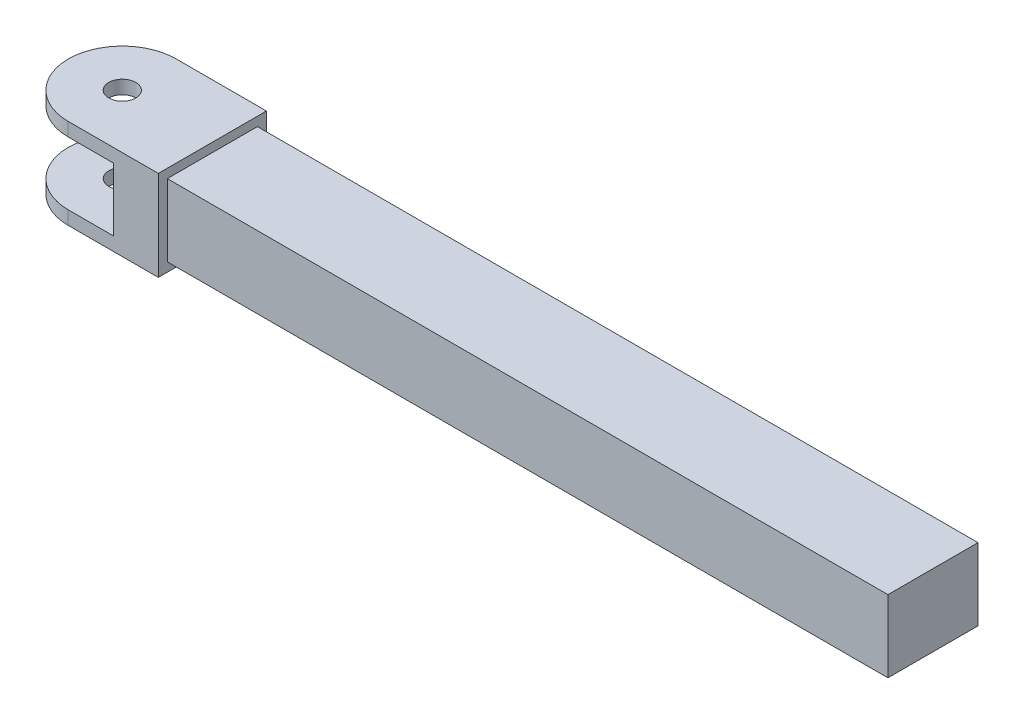
ISO-10303-21;
HEADER;
FILE_DESCRIPTION(('STEP AP214'),'2;1');
FILE_NAME('part.step','',(''),(''),'','','');
FILE_SCHEMA(('AUTOMOTIVE_DESIGN { 1 0 10303 214 1 1 1 1 }'));
ENDSEC;
DATA;
#1=APPLICATION_CONTEXT('core data for automotive mechanical design processes');
#2=APPLICATION_PROTOCOL_DEFINITION('international standard','automotive_design',2000,#1);
#3=PRODUCT_CONTEXT('',#1,'mechanical');
#4=PRODUCT('Part','Part','',(#3));
#5=PRODUCT_RELATED_PRODUCT_CATEGORY('part','',(#4));
#6=PRODUCT_DEFINITION_FORMATION('','',#4);
#7=PRODUCT_DEFINITION_CONTEXT('part definition',#1,'design');
#8=PRODUCT_DEFINITION('design','',#6,#7);
#9=PRODUCT_DEFINITION_SHAPE('','',#8);
#10=(LENGTH_UNIT() NAMED_UNIT(*) SI_UNIT(.MILLI.,.METRE.));
#11=(NAMED_UNIT(*) PLANE_ANGLE_UNIT() SI_UNIT($,.RADIAN.));
#12=(NAMED_UNIT(*) SI_UNIT($,.STERADIAN.) SOLID_ANGLE_UNIT());
#13=UNCERTAINTY_MEASURE_WITH_UNIT(LENGTH_MEASURE(1.E-05),#10,'distance_accuracy_value','');
#14=(GEOMETRIC_REPRESENTATION_CONTEXT(3) GLOBAL_UNCERTAINTY_ASSIGNED_CONTEXT((#13)) GLOBAL_UNIT_ASSIGNED_CONTEXT((#10,
#11,#12)) REPRESENTATION_CONTEXT('',''));
#15=CARTESIAN_POINT('',(0.,0.,0.));
#16=DIRECTION('',(0.,0.,1.));
#17=DIRECTION('',(1.,0.,0.));
#18=AXIS2_PLACEMENT_3D('',#15,#16,#17);
#19=CARTESIAN_POINT('',(0.,10.,0.));
#20=DIRECTION('',(0.,1.,0.));
#21=DIRECTION('',(0.,0.,1.));
#22=AXIS2_PLACEMENT_3D('',#19,#20,#21);
#23=PLANE('',#22);
#24=CARTESIAN_POINT('',(0.,10.,0.));
#25=DIRECTION('',(0.,1.,0.));
#26=DIRECTION('',(0.,0.,1.));
#27=AXIS2_PLACEMENT_3D('',#24,#25,#26);
#28=CIRCLE('',#27,1.5);
#29=CARTESIAN_POINT('',(0.,10.,1.5));
#30=VERTEX_POINT('',#29);
#31=EDGE_CURVE('E244',#30,#30,#28,.T.);
#32=ORIENTED_EDGE('',*,*,#31,.F.);
#33=EDGE_LOOP('',(#32));
#34=FACE_BOUND('',#33,.T.);
#35=DIRECTION('',(1.,0.,0.));
#36=VECTOR('',#35,1.);
#37=CARTESIAN_POINT('',(0.,10.,6.));
#38=LINE('',#37,#36);
#39=CARTESIAN_POINT('',(0.,10.,6.));
#40=VERTEX_POINT('',#39);
#41=CARTESIAN_POINT('',(9.99999999999999,10.,6.));
#42=VERTEX_POINT('',#41);
#43=EDGE_CURVE('E256',#40,#42,#38,.T.);
#44=ORIENTED_EDGE('',*,*,#43,.T.);
#45=DIRECTION('',(0.,0.,-1.));
#46=VECTOR('',#45,1.);
#47=CARTESIAN_POINT('',(9.99999999999999,10.,0.));
#48=LINE('',#47,#46);
#49=CARTESIAN_POINT('',(9.99999999999999,10.,-6.));
#50=VERTEX_POINT('',#49);
#51=EDGE_CURVE('E199',#42,#50,#48,.T.);
#52=ORIENTED_EDGE('',*,*,#51,.T.);
#53=DIRECTION('',(-1.,0.,0.));
#54=VECTOR('',#53,1.);
#55=CARTESIAN_POINT('',(0.,10.,-6.));
#56=LINE('',#55,#54);
#57=CARTESIAN_POINT('',(0.,10.,-6.));
#58=VERTEX_POINT('',#57);
#59=EDGE_CURVE('E261',#50,#58,#56,.T.);
#60=ORIENTED_EDGE('',*,*,#59,.T.);
#61=CARTESIAN_POINT('',(0.,10.,0.));
#62=DIRECTION('',(0.,1.,0.));
#63=DIRECTION('',(0.,0.,1.));
#64=AXIS2_PLACEMENT_3D('',#61,#62,#63);
#65=CIRCLE('',#64,6.);
#66=EDGE_CURVE('E252',#58,#40,#65,.T.);
#67=ORIENTED_EDGE('',*,*,#66,.T.);
#68=EDGE_LOOP('',(#44,#52,#60,#67));
#69=FACE_BOUND('',#68,.T.);
#70=ADVANCED_FACE('F53',(#34,#69),#23,.T.);
#71=CARTESIAN_POINT('',(0.,0.,0.));
#72=DIRECTION('',(0.,1.,0.));
#73=DIRECTION('',(0.,0.,1.));
#74=AXIS2_PLACEMENT_3D('',#71,#72,#73);
#75=PLANE('',#74);
#76=CARTESIAN_POINT('',(0.,0.,0.));
#77=DIRECTION('',(0.,1.,0.));
#78=DIRECTION('',(0.,0.,1.));
#79=AXIS2_PLACEMENT_3D('',#76,#77,#78);
#80=CIRCLE('',#79,1.5);
#81=CARTESIAN_POINT('',(0.,0.,1.5));
#82=VERTEX_POINT('',#81);
#83=EDGE_CURVE('E243',#82,#82,#80,.T.);
#84=ORIENTED_EDGE('',*,*,#83,.T.);
#85=EDGE_LOOP('',(#84));
#86=FACE_BOUND('',#85,.T.);
#87=DIRECTION('',(0.,0.,-1.));
#88=VECTOR('',#87,1.);
#89=CARTESIAN_POINT('',(9.99999999999999,0.,0.));
#90=LINE('',#89,#88);
#91=CARTESIAN_POINT('',(9.99999999999999,0.,6.));
#92=VERTEX_POINT('',#91);
#93=CARTESIAN_POINT('',(9.99999999999999,0.,-6.));
#94=VERTEX_POINT('',#93);
#95=EDGE_CURVE('E76',#92,#94,#90,.T.);
#96=ORIENTED_EDGE('',*,*,#95,.F.);
#97=DIRECTION('',(1.,0.,0.));
#98=VECTOR('',#97,1.);
#99=CARTESIAN_POINT('',(0.,0.,6.));
#100=LINE('',#99,#98);
#101=CARTESIAN_POINT('',(0.,0.,6.));
#102=VERTEX_POINT('',#101);
#103=EDGE_CURVE('E268',#102,#92,#100,.T.);
#104=ORIENTED_EDGE('',*,*,#103,.F.);
#105=CARTESIAN_POINT('',(0.,0.,0.));
#106=DIRECTION('',(0.,1.,0.));
#107=DIRECTION('',(0.,0.,1.));
#108=AXIS2_PLACEMENT_3D('',#105,#106,#107);
#109=CIRCLE('',#108,6.);
#110=CARTESIAN_POINT('',(0.,0.,-6.));
#111=VERTEX_POINT('',#110);
#112=EDGE_CURVE('E248',#111,#102,#109,.T.);
#113=ORIENTED_EDGE('',*,*,#112,.F.);
#114=DIRECTION('',(-1.,0.,0.));
#115=VECTOR('',#114,1.);
#116=CARTESIAN_POINT('',(0.,0.,-6.));
#117=LINE('',#116,#115);
#118=EDGE_CURVE('E257',#94,#111,#117,.T.);
#119=ORIENTED_EDGE('',*,*,#118,.F.);
#120=EDGE_LOOP('',(#96,#104,#113,#119));
#121=FACE_BOUND('',#120,.T.);
#122=ADVANCED_FACE('F300',(#86,#121),#75,.F.);
#123=CARTESIAN_POINT('',(0.,10.,6.));
#124=DIRECTION('',(0.,0.,-1.));
#125=DIRECTION('',(-1.,0.,0.));
#126=AXIS2_PLACEMENT_3D('',#123,#124,#125);
#127=PLANE('',#126);
#128=DIRECTION('',(0.,-1.,0.));
#129=VECTOR('',#128,1.);
#130=CARTESIAN_POINT('',(9.99999999999999,10.,6.));
#131=LINE('',#130,#129);
#132=EDGE_CURVE('E203',#42,#92,#131,.T.);
#133=ORIENTED_EDGE('',*,*,#132,.F.);
#134=ORIENTED_EDGE('',*,*,#43,.F.);
#135=DIRECTION('',(0.,-1.,0.));
#136=VECTOR('',#135,1.);
#137=CARTESIAN_POINT('',(0.,10.,6.));
#138=LINE('',#137,#136);
#139=CARTESIAN_POINT('',(0.,8.5,6.));
#140=VERTEX_POINT('',#139);
#141=EDGE_CURVE('E62',#40,#140,#138,.T.);
#142=ORIENTED_EDGE('',*,*,#141,.T.);
#143=DIRECTION('',(1.,0.,0.));
#144=VECTOR('',#143,1.);
#145=CARTESIAN_POINT('',(5.,8.5,6.));
#146=LINE('',#145,#144);
#147=CARTESIAN_POINT('',(5.,8.5,6.));
#148=VERTEX_POINT('',#147);
#149=EDGE_CURVE('E207',#140,#148,#146,.T.);
#150=ORIENTED_EDGE('',*,*,#149,.T.);
#151=DIRECTION('',(0.,-1.,0.));
#152=VECTOR('',#151,1.);
#153=CARTESIAN_POINT('',(5.,8.5,6.));
#154=LINE('',#153,#152);
#155=CARTESIAN_POINT('',(5.,1.5,6.));
#156=VERTEX_POINT('',#155);
#157=EDGE_CURVE('E211',#148,#156,#154,.T.);
#158=ORIENTED_EDGE('',*,*,#157,.T.);
#159=DIRECTION('',(-1.,0.,0.));
#160=VECTOR('',#159,1.);
#161=CARTESIAN_POINT('',(5.,1.5,6.));
#162=LINE('',#161,#160);
#163=CARTESIAN_POINT('',(0.,1.5,6.));
#164=VERTEX_POINT('',#163);
#165=EDGE_CURVE('E216',#156,#164,#162,.T.);
#166=ORIENTED_EDGE('',*,*,#165,.T.);
#167=EDGE_CURVE('E278',#164,#102,#138,.T.);
#168=ORIENTED_EDGE('',*,*,#167,.T.);
#169=ORIENTED_EDGE('',*,*,#103,.T.);
#170=EDGE_LOOP('',(#133,#134,#142,#150,#158,#166,#168,#169));
#171=FACE_BOUND('',#170,.T.);
#172=ADVANCED_FACE('F303',(#171),#127,.F.);
#173=CARTESIAN_POINT('',(0.,10.,-6.));
#174=DIRECTION('',(0.,0.,1.));
#175=DIRECTION('',(1.,0.,0.));
#176=AXIS2_PLACEMENT_3D('',#173,#174,#175);
#177=PLANE('',#176);
#178=DIRECTION('',(0.,1.,0.));
#179=VECTOR('',#178,1.);
#180=CARTESIAN_POINT('',(9.99999999999999,10.,-6.));
#181=LINE('',#180,#179);
#182=EDGE_CURVE('E13',#94,#50,#181,.T.);
#183=ORIENTED_EDGE('',*,*,#182,.F.);
#184=ORIENTED_EDGE('',*,*,#118,.T.);
#185=DIRECTION('',(0.,-1.,0.));
#186=VECTOR('',#185,1.);
#187=CARTESIAN_POINT('',(0.,10.,-6.));
#188=LINE('',#187,#186);
#189=CARTESIAN_POINT('',(0.,1.5,-6.));
#190=VERTEX_POINT('',#189);
#191=EDGE_CURVE('E264',#190,#111,#188,.T.);
#192=ORIENTED_EDGE('',*,*,#191,.F.);
#193=DIRECTION('',(-1.,0.,0.));
#194=VECTOR('',#193,1.);
#195=CARTESIAN_POINT('',(5.,1.5,-6.));
#196=LINE('',#195,#194);
#197=CARTESIAN_POINT('',(5.,1.5,-6.));
#198=VERTEX_POINT('',#197);
#199=EDGE_CURVE('E212',#198,#190,#196,.T.);
#200=ORIENTED_EDGE('',*,*,#199,.F.);
#201=DIRECTION('',(0.,-1.,0.));
#202=VECTOR('',#201,1.);
#203=CARTESIAN_POINT('',(5.,8.5,-6.));
#204=LINE('',#203,#202);
#205=CARTESIAN_POINT('',(5.,8.5,-6.));
#206=VERTEX_POINT('',#205);
#207=EDGE_CURVE('E223',#206,#198,#204,.T.);
#208=ORIENTED_EDGE('',*,*,#207,.F.);
#209=DIRECTION('',(1.,0.,0.));
#210=VECTOR('',#209,1.);
#211=CARTESIAN_POINT('',(5.,8.5,-6.));
#212=LINE('',#211,#210);
#213=CARTESIAN_POINT('',(0.,8.5,-6.));
#214=VERTEX_POINT('',#213);
#215=EDGE_CURVE('E206',#214,#206,#212,.T.);
#216=ORIENTED_EDGE('',*,*,#215,.F.);
#217=EDGE_CURVE('E274',#58,#214,#188,.T.);
#218=ORIENTED_EDGE('',*,*,#217,.F.);
#219=ORIENTED_EDGE('',*,*,#59,.F.);
#220=EDGE_LOOP('',(#183,#184,#192,#200,#208,#216,#218,#219));
#221=FACE_BOUND('',#220,.T.);
#222=ADVANCED_FACE('F357',(#221),#177,.F.);
#223=CARTESIAN_POINT('',(0.,10.,0.));
#224=DIRECTION('',(0.,-1.,0.));
#225=DIRECTION('',(0.,0.,-1.));
#226=AXIS2_PLACEMENT_3D('',#223,#224,#225);
#227=CYLINDRICAL_SURFACE('',#226,6.);
#228=ORIENTED_EDGE('',*,*,#167,.F.);
#229=CARTESIAN_POINT('',(0.,1.5,0.));
#230=DIRECTION('',(0.,-1.,0.));
#231=DIRECTION('',(0.,0.,-1.));
#232=AXIS2_PLACEMENT_3D('',#229,#230,#231);
#233=CIRCLE('',#232,6.);
#234=EDGE_CURVE('E240',#164,#190,#233,.T.);
#235=ORIENTED_EDGE('',*,*,#234,.T.);
#236=ORIENTED_EDGE('',*,*,#191,.T.);
#237=ORIENTED_EDGE('',*,*,#112,.T.);
#238=EDGE_LOOP('',(#228,#235,#236,#237));
#239=FACE_BOUND('',#238,.T.);
#240=ADVANCED_FACE('F295',(#239),#227,.T.);
#241=CARTESIAN_POINT('',(0.,10.,0.));
#242=DIRECTION('',(0.,-1.,0.));
#243=DIRECTION('',(0.,0.,-1.));
#244=AXIS2_PLACEMENT_3D('',#241,#242,#243);
#245=CYLINDRICAL_SURFACE('',#244,1.5);
#246=CARTESIAN_POINT('',(0.,1.5,0.));
#247=DIRECTION('',(0.,-1.,0.));
#248=DIRECTION('',(0.,0.,-1.));
#249=AXIS2_PLACEMENT_3D('',#246,#247,#248);
#250=CIRCLE('',#249,1.5);
#251=CARTESIAN_POINT('',(0.,1.5,-1.5));
#252=VERTEX_POINT('',#251);
#253=EDGE_CURVE('E239',#252,#252,#250,.T.);
#254=ORIENTED_EDGE('',*,*,#253,.F.);
#255=EDGE_LOOP('',(#254));
#256=FACE_BOUND('',#255,.T.);
#257=ORIENTED_EDGE('',*,*,#83,.F.);
#258=EDGE_LOOP('',(#257));
#259=FACE_BOUND('',#258,.T.);
#260=ADVANCED_FACE('F292',(#256,#259),#245,.F.);
#261=ORIENTED_EDGE('',*,*,#217,.T.);
#262=CARTESIAN_POINT('',(0.,8.5,0.));
#263=DIRECTION('',(0.,1.,0.));
#264=DIRECTION('',(0.,0.,1.));
#265=AXIS2_PLACEMENT_3D('',#262,#263,#264);
#266=CIRCLE('',#265,6.);
#267=EDGE_CURVE('E235',#214,#140,#266,.T.);
#268=ORIENTED_EDGE('',*,*,#267,.T.);
#269=ORIENTED_EDGE('',*,*,#141,.F.);
#270=ORIENTED_EDGE('',*,*,#66,.F.);
#271=EDGE_LOOP('',(#261,#268,#269,#270));
#272=FACE_BOUND('',#271,.T.);
#273=ADVANCED_FACE('F55',(#272),#227,.T.);
#274=CARTESIAN_POINT('',(0.,8.5,0.));
#275=DIRECTION('',(0.,1.,0.));
#276=DIRECTION('',(0.,0.,1.));
#277=AXIS2_PLACEMENT_3D('',#274,#275,#276);
#278=CIRCLE('',#277,1.5);
#279=CARTESIAN_POINT('',(0.,8.5,1.5));
#280=VERTEX_POINT('',#279);
#281=EDGE_CURVE('E232',#280,#280,#278,.T.);
#282=ORIENTED_EDGE('',*,*,#281,.F.);
#283=EDGE_LOOP('',(#282));
#284=FACE_BOUND('',#283,.T.);
#285=ORIENTED_EDGE('',*,*,#31,.T.);
#286=EDGE_LOOP('',(#285));
#287=FACE_BOUND('',#286,.T.);
#288=ADVANCED_FACE('F297',(#284,#287),#245,.F.);
#289=CARTESIAN_POINT('',(5.,1.5,6.));
#290=DIRECTION('',(0.,-1.,0.));
#291=DIRECTION('',(0.,0.,-1.));
#292=AXIS2_PLACEMENT_3D('',#289,#290,#291);
#293=PLANE('',#292);
#294=ORIENTED_EDGE('',*,*,#253,.T.);
#295=EDGE_LOOP('',(#294));
#296=FACE_BOUND('',#295,.T.);
#297=ORIENTED_EDGE('',*,*,#165,.F.);
#298=DIRECTION('',(0.,0.,-1.));
#299=VECTOR('',#298,1.);
#300=CARTESIAN_POINT('',(5.,1.5,6.));
#301=LINE('',#300,#299);
#302=EDGE_CURVE('E229',#156,#198,#301,.T.);
#303=ORIENTED_EDGE('',*,*,#302,.T.);
#304=ORIENTED_EDGE('',*,*,#199,.T.);
#305=ORIENTED_EDGE('',*,*,#234,.F.);
#306=EDGE_LOOP('',(#297,#303,#304,#305));
#307=FACE_BOUND('',#306,.T.);
#308=ADVANCED_FACE('F289',(#296,#307),#293,.F.);
#309=CARTESIAN_POINT('',(5.,8.5,6.));
#310=DIRECTION('',(0.,1.,0.));
#311=DIRECTION('',(0.,0.,1.));
#312=AXIS2_PLACEMENT_3D('',#309,#310,#311);
#313=PLANE('',#312);
#314=ORIENTED_EDGE('',*,*,#281,.T.);
#315=EDGE_LOOP('',(#314));
#316=FACE_BOUND('',#315,.T.);
#317=ORIENTED_EDGE('',*,*,#215,.T.);
#318=DIRECTION('',(0.,0.,-1.));
#319=VECTOR('',#318,1.);
#320=CARTESIAN_POINT('',(5.,8.5,6.));
#321=LINE('',#320,#319);
#322=EDGE_CURVE('E220',#148,#206,#321,.T.);
#323=ORIENTED_EDGE('',*,*,#322,.F.);
#324=ORIENTED_EDGE('',*,*,#149,.F.);
#325=ORIENTED_EDGE('',*,*,#267,.F.);
#326=EDGE_LOOP('',(#317,#323,#324,#325));
#327=FACE_BOUND('',#326,.T.);
#328=ADVANCED_FACE('F367',(#316,#327),#313,.F.);
#329=CARTESIAN_POINT('',(5.,8.5,6.));
#330=DIRECTION('',(1.,0.,0.));
#331=DIRECTION('',(0.,1.,0.));
#332=AXIS2_PLACEMENT_3D('',#329,#330,#331);
#333=PLANE('',#332);
#334=ORIENTED_EDGE('',*,*,#207,.T.);
#335=ORIENTED_EDGE('',*,*,#302,.F.);
#336=ORIENTED_EDGE('',*,*,#157,.F.);
#337=ORIENTED_EDGE('',*,*,#322,.T.);
#338=EDGE_LOOP('',(#334,#335,#336,#337));
#339=FACE_BOUND('',#338,.T.);
#340=ADVANCED_FACE('F369',(#339),#333,.F.);
#341=CARTESIAN_POINT('',(9.99999999999999,5.,0.));
#342=DIRECTION('',(1.,0.,0.));
#343=DIRECTION('',(0.,0.,-1.));
#344=AXIS2_PLACEMENT_3D('',#341,#342,#343);
#345=PLANE('',#344);
#346=DIRECTION('',(0.,0.,1.));
#347=VECTOR('',#346,1.);
#348=CARTESIAN_POINT('',(9.99999999999999,9.,-5.));
#349=LINE('',#348,#347);
#350=CARTESIAN_POINT('',(9.99999999999999,9.,-5.));
#351=VERTEX_POINT('',#350);
#352=CARTESIAN_POINT('',(9.99999999999999,9.,5.));
#353=VERTEX_POINT('',#352);
#354=EDGE_CURVE('E155',#351,#353,#349,.T.);
#355=ORIENTED_EDGE('',*,*,#354,.F.);
#356=DIRECTION('',(0.,1.,0.));
#357=VECTOR('',#356,1.);
#358=CARTESIAN_POINT('',(9.99999999999999,1.,-5.));
#359=LINE('',#358,#357);
#360=CARTESIAN_POINT('',(9.99999999999999,1.,-5.));
#361=VERTEX_POINT('',#360);
#362=EDGE_CURVE('E164',#361,#351,#359,.T.);
#363=ORIENTED_EDGE('',*,*,#362,.F.);
#364=DIRECTION('',(0.,0.,-1.));
#365=VECTOR('',#364,1.);
#366=CARTESIAN_POINT('',(9.99999999999999,1.,5.));
#367=LINE('',#366,#365);
#368=CARTESIAN_POINT('',(9.99999999999999,1.,5.));
#369=VERTEX_POINT('',#368);
#370=EDGE_CURVE('E146',#369,#361,#367,.T.);
#371=ORIENTED_EDGE('',*,*,#370,.F.);
#372=DIRECTION('',(0.,-1.,0.));
#373=VECTOR('',#372,1.);
#374=CARTESIAN_POINT('',(9.99999999999999,9.,5.));
#375=LINE('',#374,#373);
#376=EDGE_CURVE('E161',#353,#369,#375,.T.);
#377=ORIENTED_EDGE('',*,*,#376,.F.);
#378=EDGE_LOOP('',(#355,#363,#371,#377));
#379=FACE_BOUND('',#378,.T.);
#380=ORIENTED_EDGE('',*,*,#132,.T.);
#381=ORIENTED_EDGE('',*,*,#95,.T.);
#382=ORIENTED_EDGE('',*,*,#182,.T.);
#383=ORIENTED_EDGE('',*,*,#51,.F.);
#384=EDGE_LOOP('',(#380,#381,#382,#383));
#385=FACE_BOUND('',#384,.T.);
#386=ADVANCED_FACE('F160',(#379,#385),#345,.T.);
#387=CARTESIAN_POINT('',(9.99999999999999,9.,5.));
#388=DIRECTION('',(0.,0.,1.));
#389=DIRECTION('',(1.,0.,0.));
#390=AXIS2_PLACEMENT_3D('',#387,#388,#389);
#391=PLANE('',#390);
#392=DIRECTION('',(0.,-1.,0.));
#393=VECTOR('',#392,1.);
#394=CARTESIAN_POINT('',(90.,9.,5.));
#395=LINE('',#394,#393);
#396=CARTESIAN_POINT('',(90.,9.,5.));
#397=VERTEX_POINT('',#396);
#398=CARTESIAN_POINT('',(90.,1.,5.));
#399=VERTEX_POINT('',#398);
#400=EDGE_CURVE('E183',#397,#399,#395,.T.);
#401=ORIENTED_EDGE('',*,*,#400,.F.);
#402=DIRECTION('',(1.,0.,0.));
#403=VECTOR('',#402,1.);
#404=CARTESIAN_POINT('',(9.99999999999999,9.,5.));
#405=LINE('',#404,#403);
#406=EDGE_CURVE('E168',#353,#397,#405,.T.);
#407=ORIENTED_EDGE('',*,*,#406,.F.);
#408=ORIENTED_EDGE('',*,*,#376,.T.);
#409=DIRECTION('',(1.,0.,0.));
#410=VECTOR('',#409,1.);
#411=CARTESIAN_POINT('',(9.99999999999999,1.,5.));
#412=LINE('',#411,#410);
#413=EDGE_CURVE('E143',#369,#399,#412,.T.);
#414=ORIENTED_EDGE('',*,*,#413,.T.);
#415=EDGE_LOOP('',(#401,#407,#408,#414));
#416=FACE_BOUND('',#415,.T.);
#417=ADVANCED_FACE('F167',(#416),#391,.T.);
#418=CARTESIAN_POINT('',(9.99999999999999,9.,-5.));
#419=DIRECTION('',(0.,1.,0.));
#420=DIRECTION('',(0.,0.,1.));
#421=AXIS2_PLACEMENT_3D('',#418,#419,#420);
#422=PLANE('',#421);
#423=DIRECTION('',(0.,0.,1.));
#424=VECTOR('',#423,1.);
#425=CARTESIAN_POINT('',(90.,9.,-5.));
#426=LINE('',#425,#424);
#427=CARTESIAN_POINT('',(90.,9.,-5.));
#428=VERTEX_POINT('',#427);
#429=EDGE_CURVE('E170',#428,#397,#426,.T.);
#430=ORIENTED_EDGE('',*,*,#429,.F.);
#431=DIRECTION('',(1.,0.,0.));
#432=VECTOR('',#431,1.);
#433=CARTESIAN_POINT('',(9.99999999999999,9.,-5.));
#434=LINE('',#433,#432);
#435=EDGE_CURVE('E192',#351,#428,#434,.T.);
#436=ORIENTED_EDGE('',*,*,#435,.F.);
#437=ORIENTED_EDGE('',*,*,#354,.T.);
#438=ORIENTED_EDGE('',*,*,#406,.T.);
#439=EDGE_LOOP('',(#430,#436,#437,#438));
#440=FACE_BOUND('',#439,.T.);
#441=ADVANCED_FACE('F444',(#440),#422,.T.);
#442=CARTESIAN_POINT('',(9.99999999999999,1.,-5.));
#443=DIRECTION('',(0.,0.,-1.));
#444=DIRECTION('',(-1.,0.,0.));
#445=AXIS2_PLACEMENT_3D('',#442,#443,#444);
#446=PLANE('',#445);
#447=DIRECTION('',(0.,1.,0.));
#448=VECTOR('',#447,1.);
#449=CARTESIAN_POINT('',(90.,1.,-5.));
#450=LINE('',#449,#448);
#451=CARTESIAN_POINT('',(90.,0.999999999999999,-5.));
#452=VERTEX_POINT('',#451);
#453=EDGE_CURVE('E69',#452,#428,#450,.T.);
#454=ORIENTED_EDGE('',*,*,#453,.F.);
#455=DIRECTION('',(1.,0.,0.));
#456=VECTOR('',#455,1.);
#457=CARTESIAN_POINT('',(9.99999999999999,1.,-5.));
#458=LINE('',#457,#456);
#459=EDGE_CURVE('E154',#361,#452,#458,.T.);
#460=ORIENTED_EDGE('',*,*,#459,.F.);
#461=ORIENTED_EDGE('',*,*,#362,.T.);
#462=ORIENTED_EDGE('',*,*,#435,.T.);
#463=EDGE_LOOP('',(#454,#460,#461,#462));
#464=FACE_BOUND('',#463,.T.);
#465=ADVANCED_FACE('F452',(#464),#446,.T.);
#466=CARTESIAN_POINT('',(9.99999999999999,1.,5.));
#467=DIRECTION('',(0.,-1.,0.));
#468=DIRECTION('',(0.,0.,-1.));
#469=AXIS2_PLACEMENT_3D('',#466,#467,#468);
#470=PLANE('',#469);
#471=DIRECTION('',(0.,0.,-1.));
#472=VECTOR('',#471,1.);
#473=CARTESIAN_POINT('',(90.,1.,5.));
#474=LINE('',#473,#472);
#475=EDGE_CURVE('E148',#399,#452,#474,.T.);
#476=ORIENTED_EDGE('',*,*,#475,.F.);
#477=ORIENTED_EDGE('',*,*,#413,.F.);
#478=ORIENTED_EDGE('',*,*,#370,.T.);
#479=ORIENTED_EDGE('',*,*,#459,.T.);
#480=EDGE_LOOP('',(#476,#477,#478,#479));
#481=FACE_BOUND('',#480,.T.);
#482=ADVANCED_FACE('F145',(#481),#470,.T.);
#483=CARTESIAN_POINT('',(90.,10.,-6.));
#484=DIRECTION('',(-1.,0.,0.));
#485=DIRECTION('',(0.,0.,1.));
#486=AXIS2_PLACEMENT_3D('',#483,#484,#485);
#487=PLANE('',#486);
#488=ORIENTED_EDGE('',*,*,#400,.T.);
#489=ORIENTED_EDGE('',*,*,#475,.T.);
#490=ORIENTED_EDGE('',*,*,#453,.T.);
#491=ORIENTED_EDGE('',*,*,#429,.T.);
#492=EDGE_LOOP('',(#488,#489,#490,#491));
#493=FACE_BOUND('',#492,.T.);
#494=ADVANCED_FACE('F391',(#493),#487,.F.);
#495=CLOSED_SHELL('',(#70,#122,#172,#222,#240,#260,#273,#288,#308,#328,#340,#386,#417,#441,#465,
#482,#494));
#496=MANIFOLD_SOLID_BREP('B2',#495);
#497=ADVANCED_BREP_SHAPE_REPRESENTATION('',(#18,#496),#14);
#498=SHAPE_DEFINITION_REPRESENTATION(#9,#497);
ENDSEC;
END-ISO-10303-21;
